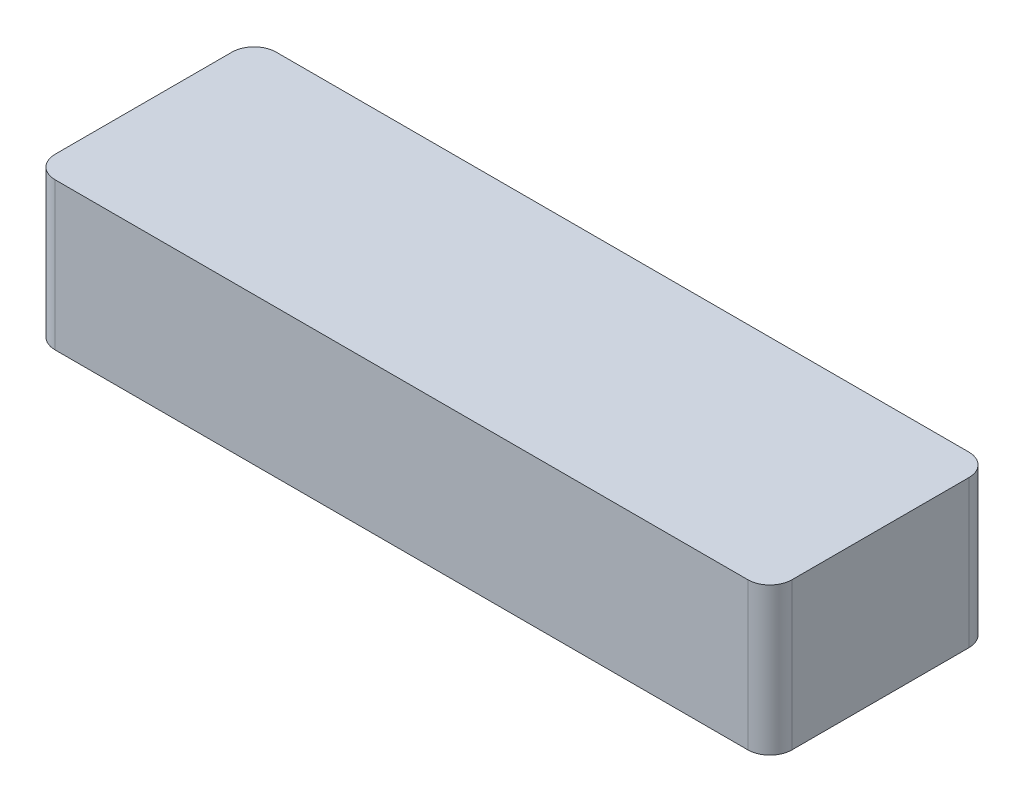
ISO-10303-21;
HEADER;
FILE_DESCRIPTION(('STEP AP214'),'2;1');
FILE_NAME('part.step','',(''),(''),'','','');
FILE_SCHEMA(('AUTOMOTIVE_DESIGN { 1 0 10303 214 1 1 1 1 }'));
ENDSEC;
DATA;
#1=APPLICATION_CONTEXT('core data for automotive mechanical design processes');
#2=APPLICATION_PROTOCOL_DEFINITION('international standard','automotive_design',2000,#1);
#3=PRODUCT_CONTEXT('',#1,'mechanical');
#4=PRODUCT('Part','Part','',(#3));
#5=PRODUCT_RELATED_PRODUCT_CATEGORY('part','',(#4));
#6=PRODUCT_DEFINITION_FORMATION('','',#4);
#7=PRODUCT_DEFINITION_CONTEXT('part definition',#1,'design');
#8=PRODUCT_DEFINITION('design','',#6,#7);
#9=PRODUCT_DEFINITION_SHAPE('','',#8);
#10=(LENGTH_UNIT() NAMED_UNIT(*) SI_UNIT(.MILLI.,.METRE.));
#11=(NAMED_UNIT(*) PLANE_ANGLE_UNIT() SI_UNIT($,.RADIAN.));
#12=(NAMED_UNIT(*) SI_UNIT($,.STERADIAN.) SOLID_ANGLE_UNIT());
#13=UNCERTAINTY_MEASURE_WITH_UNIT(LENGTH_MEASURE(1.E-05),#10,'distance_accuracy_value','');
#14=(GEOMETRIC_REPRESENTATION_CONTEXT(3) GLOBAL_UNCERTAINTY_ASSIGNED_CONTEXT((#13)) GLOBAL_UNIT_ASSIGNED_CONTEXT((#10,
#11,#12)) REPRESENTATION_CONTEXT('',''));
#15=CARTESIAN_POINT('',(0.,0.,0.));
#16=DIRECTION('',(0.,0.,1.));
#17=DIRECTION('',(1.,0.,0.));
#18=AXIS2_PLACEMENT_3D('',#15,#16,#17);
#19=CARTESIAN_POINT('',(-235.,100.,60.));
#20=DIRECTION('',(0.,-1.,0.));
#21=DIRECTION('',(0.,0.,-1.));
#22=AXIS2_PLACEMENT_3D('',#19,#20,#21);
#23=CYLINDRICAL_SURFACE('',#22,15.);
#24=CARTESIAN_POINT('',(-235.,0.,60.));
#25=DIRECTION('',(0.,1.,0.));
#26=DIRECTION('',(0.,0.,1.));
#27=AXIS2_PLACEMENT_3D('',#24,#25,#26);
#28=CIRCLE('',#27,15.);
#29=CARTESIAN_POINT('',(-250.,0.,59.9999999999999));
#30=VERTEX_POINT('',#29);
#31=CARTESIAN_POINT('',(-235.,0.,75.));
#32=VERTEX_POINT('',#31);
#33=EDGE_CURVE('E141',#30,#32,#28,.T.);
#34=ORIENTED_EDGE('',*,*,#33,.T.);
#35=DIRECTION('',(0.,-1.,0.));
#36=VECTOR('',#35,1.);
#37=CARTESIAN_POINT('',(-235.,100.,75.));
#38=LINE('',#37,#36);
#39=CARTESIAN_POINT('',(-235.,100.,75.));
#40=VERTEX_POINT('',#39);
#41=EDGE_CURVE('E11',#40,#32,#38,.T.);
#42=ORIENTED_EDGE('',*,*,#41,.F.);
#43=CARTESIAN_POINT('',(-235.,100.,60.));
#44=DIRECTION('',(0.,1.,0.));
#45=DIRECTION('',(0.,0.,1.));
#46=AXIS2_PLACEMENT_3D('',#43,#44,#45);
#47=CIRCLE('',#46,15.);
#48=CARTESIAN_POINT('',(-250.,100.,59.9999999999999));
#49=VERTEX_POINT('',#48);
#50=EDGE_CURVE('E157',#49,#40,#47,.T.);
#51=ORIENTED_EDGE('',*,*,#50,.F.);
#52=DIRECTION('',(0.,-1.,0.));
#53=VECTOR('',#52,1.);
#54=CARTESIAN_POINT('',(-250.,100.,59.9999999999999));
#55=LINE('',#54,#53);
#56=EDGE_CURVE('E137',#49,#30,#55,.T.);
#57=ORIENTED_EDGE('',*,*,#56,.T.);
#58=EDGE_LOOP('',(#34,#42,#51,#57));
#59=FACE_BOUND('',#58,.T.);
#60=ADVANCED_FACE('F33',(#59),#23,.T.);
#61=CARTESIAN_POINT('',(-235.,100.,75.));
#62=DIRECTION('',(0.,0.,-1.));
#63=DIRECTION('',(-1.,0.,0.));
#64=AXIS2_PLACEMENT_3D('',#61,#62,#63);
#65=PLANE('',#64);
#66=DIRECTION('',(1.,0.,0.));
#67=VECTOR('',#66,1.);
#68=CARTESIAN_POINT('',(-235.,0.,75.));
#69=LINE('',#68,#67);
#70=CARTESIAN_POINT('',(235.,0.,75.));
#71=VERTEX_POINT('',#70);
#72=EDGE_CURVE('E144',#32,#71,#69,.T.);
#73=ORIENTED_EDGE('',*,*,#72,.T.);
#74=DIRECTION('',(0.,-1.,0.));
#75=VECTOR('',#74,1.);
#76=CARTESIAN_POINT('',(235.,100.,75.));
#77=LINE('',#76,#75);
#78=CARTESIAN_POINT('',(235.,100.,75.));
#79=VERTEX_POINT('',#78);
#80=EDGE_CURVE('E40',#79,#71,#77,.T.);
#81=ORIENTED_EDGE('',*,*,#80,.F.);
#82=DIRECTION('',(1.,0.,0.));
#83=VECTOR('',#82,1.);
#84=CARTESIAN_POINT('',(-235.,100.,75.));
#85=LINE('',#84,#83);
#86=EDGE_CURVE('E97',#40,#79,#85,.T.);
#87=ORIENTED_EDGE('',*,*,#86,.F.);
#88=ORIENTED_EDGE('',*,*,#41,.T.);
#89=EDGE_LOOP('',(#73,#81,#87,#88));
#90=FACE_BOUND('',#89,.T.);
#91=ADVANCED_FACE('F320',(#90),#65,.F.);
#92=CARTESIAN_POINT('',(235.,100.,60.));
#93=DIRECTION('',(0.,-1.,0.));
#94=DIRECTION('',(0.,0.,-1.));
#95=AXIS2_PLACEMENT_3D('',#92,#93,#94);
#96=CYLINDRICAL_SURFACE('',#95,15.);
#97=CARTESIAN_POINT('',(235.,0.,60.));
#98=DIRECTION('',(0.,1.,0.));
#99=DIRECTION('',(0.,0.,1.));
#100=AXIS2_PLACEMENT_3D('',#97,#98,#99);
#101=CIRCLE('',#100,15.);
#102=CARTESIAN_POINT('',(250.,0.,59.9999999999999));
#103=VERTEX_POINT('',#102);
#104=EDGE_CURVE('E147',#71,#103,#101,.T.);
#105=ORIENTED_EDGE('',*,*,#104,.T.);
#106=DIRECTION('',(0.,-1.,0.));
#107=VECTOR('',#106,1.);
#108=CARTESIAN_POINT('',(250.,100.,59.9999999999999));
#109=LINE('',#108,#107);
#110=CARTESIAN_POINT('',(250.,100.,59.9999999999999));
#111=VERTEX_POINT('',#110);
#112=EDGE_CURVE('E164',#111,#103,#109,.T.);
#113=ORIENTED_EDGE('',*,*,#112,.F.);
#114=CARTESIAN_POINT('',(235.,100.,60.));
#115=DIRECTION('',(0.,1.,0.));
#116=DIRECTION('',(0.,0.,1.));
#117=AXIS2_PLACEMENT_3D('',#114,#115,#116);
#118=CIRCLE('',#117,15.);
#119=EDGE_CURVE('E172',#79,#111,#118,.T.);
#120=ORIENTED_EDGE('',*,*,#119,.F.);
#121=ORIENTED_EDGE('',*,*,#80,.T.);
#122=EDGE_LOOP('',(#105,#113,#120,#121));
#123=FACE_BOUND('',#122,.T.);
#124=ADVANCED_FACE('F170',(#123),#96,.T.);
#125=CARTESIAN_POINT('',(250.,100.,59.9999999999999));
#126=DIRECTION('',(-1.,0.,0.));
#127=DIRECTION('',(0.,0.,1.));
#128=AXIS2_PLACEMENT_3D('',#125,#126,#127);
#129=PLANE('',#128);
#130=DIRECTION('',(0.,0.,-1.));
#131=VECTOR('',#130,1.);
#132=CARTESIAN_POINT('',(250.,0.,59.9999999999999));
#133=LINE('',#132,#131);
#134=CARTESIAN_POINT('',(250.,0.,-59.9999999999999));
#135=VERTEX_POINT('',#134);
#136=EDGE_CURVE('E149',#103,#135,#133,.T.);
#137=ORIENTED_EDGE('',*,*,#136,.T.);
#138=DIRECTION('',(0.,-1.,0.));
#139=VECTOR('',#138,1.);
#140=CARTESIAN_POINT('',(250.,100.,-59.9999999999999));
#141=LINE('',#140,#139);
#142=CARTESIAN_POINT('',(250.,100.,-59.9999999999999));
#143=VERTEX_POINT('',#142);
#144=EDGE_CURVE('E161',#143,#135,#141,.T.);
#145=ORIENTED_EDGE('',*,*,#144,.F.);
#146=DIRECTION('',(0.,0.,-1.));
#147=VECTOR('',#146,1.);
#148=CARTESIAN_POINT('',(250.,100.,59.9999999999999));
#149=LINE('',#148,#147);
#150=EDGE_CURVE('E184',#111,#143,#149,.T.);
#151=ORIENTED_EDGE('',*,*,#150,.F.);
#152=ORIENTED_EDGE('',*,*,#112,.T.);
#153=EDGE_LOOP('',(#137,#145,#151,#152));
#154=FACE_BOUND('',#153,.T.);
#155=ADVANCED_FACE('F180',(#154),#129,.F.);
#156=CARTESIAN_POINT('',(235.,100.,-60.));
#157=DIRECTION('',(0.,-1.,0.));
#158=DIRECTION('',(0.,0.,-1.));
#159=AXIS2_PLACEMENT_3D('',#156,#157,#158);
#160=CYLINDRICAL_SURFACE('',#159,15.);
#161=CARTESIAN_POINT('',(235.,0.,-60.));
#162=DIRECTION('',(0.,1.,0.));
#163=DIRECTION('',(0.,0.,1.));
#164=AXIS2_PLACEMENT_3D('',#161,#162,#163);
#165=CIRCLE('',#164,15.);
#166=CARTESIAN_POINT('',(235.,0.,-75.));
#167=VERTEX_POINT('',#166);
#168=EDGE_CURVE('E151',#135,#167,#165,.T.);
#169=ORIENTED_EDGE('',*,*,#168,.T.);
#170=DIRECTION('',(0.,-1.,0.));
#171=VECTOR('',#170,1.);
#172=CARTESIAN_POINT('',(235.,100.,-75.));
#173=LINE('',#172,#171);
#174=CARTESIAN_POINT('',(235.,100.,-75.));
#175=VERTEX_POINT('',#174);
#176=EDGE_CURVE('E132',#175,#167,#173,.T.);
#177=ORIENTED_EDGE('',*,*,#176,.F.);
#178=CARTESIAN_POINT('',(235.,100.,-60.));
#179=DIRECTION('',(0.,1.,0.));
#180=DIRECTION('',(0.,0.,1.));
#181=AXIS2_PLACEMENT_3D('',#178,#179,#180);
#182=CIRCLE('',#181,15.);
#183=EDGE_CURVE('E120',#143,#175,#182,.T.);
#184=ORIENTED_EDGE('',*,*,#183,.F.);
#185=ORIENTED_EDGE('',*,*,#144,.T.);
#186=EDGE_LOOP('',(#169,#177,#184,#185));
#187=FACE_BOUND('',#186,.T.);
#188=ADVANCED_FACE('F183',(#187),#160,.T.);
#189=CARTESIAN_POINT('',(-235.,100.,-75.));
#190=DIRECTION('',(0.,0.,1.));
#191=DIRECTION('',(1.,0.,0.));
#192=AXIS2_PLACEMENT_3D('',#189,#190,#191);
#193=PLANE('',#192);
#194=DIRECTION('',(-1.,0.,0.));
#195=VECTOR('',#194,1.);
#196=CARTESIAN_POINT('',(-235.,0.,-75.));
#197=LINE('',#196,#195);
#198=CARTESIAN_POINT('',(-235.,0.,-75.));
#199=VERTEX_POINT('',#198);
#200=EDGE_CURVE('E129',#167,#199,#197,.T.);
#201=ORIENTED_EDGE('',*,*,#200,.T.);
#202=DIRECTION('',(0.,-1.,0.));
#203=VECTOR('',#202,1.);
#204=CARTESIAN_POINT('',(-235.,100.,-75.));
#205=LINE('',#204,#203);
#206=CARTESIAN_POINT('',(-235.,100.,-75.));
#207=VERTEX_POINT('',#206);
#208=EDGE_CURVE('E126',#207,#199,#205,.T.);
#209=ORIENTED_EDGE('',*,*,#208,.F.);
#210=DIRECTION('',(-1.,0.,0.));
#211=VECTOR('',#210,1.);
#212=CARTESIAN_POINT('',(-235.,100.,-75.));
#213=LINE('',#212,#211);
#214=EDGE_CURVE('E113',#175,#207,#213,.T.);
#215=ORIENTED_EDGE('',*,*,#214,.F.);
#216=ORIENTED_EDGE('',*,*,#176,.T.);
#217=EDGE_LOOP('',(#201,#209,#215,#216));
#218=FACE_BOUND('',#217,.T.);
#219=ADVANCED_FACE('F127',(#218),#193,.F.);
#220=CARTESIAN_POINT('',(-235.,100.,-60.));
#221=DIRECTION('',(0.,-1.,0.));
#222=DIRECTION('',(0.,0.,-1.));
#223=AXIS2_PLACEMENT_3D('',#220,#221,#222);
#224=CYLINDRICAL_SURFACE('',#223,15.);
#225=CARTESIAN_POINT('',(-235.,0.,-60.));
#226=DIRECTION('',(0.,1.,0.));
#227=DIRECTION('',(0.,0.,1.));
#228=AXIS2_PLACEMENT_3D('',#225,#226,#227);
#229=CIRCLE('',#228,15.);
#230=CARTESIAN_POINT('',(-250.,0.,-59.9999999999999));
#231=VERTEX_POINT('',#230);
#232=EDGE_CURVE('E154',#199,#231,#229,.T.);
#233=ORIENTED_EDGE('',*,*,#232,.T.);
#234=DIRECTION('',(0.,-1.,0.));
#235=VECTOR('',#234,1.);
#236=CARTESIAN_POINT('',(-250.,100.,-59.9999999999999));
#237=LINE('',#236,#235);
#238=CARTESIAN_POINT('',(-250.,100.,-59.9999999999999));
#239=VERTEX_POINT('',#238);
#240=EDGE_CURVE('E133',#239,#231,#237,.T.);
#241=ORIENTED_EDGE('',*,*,#240,.F.);
#242=CARTESIAN_POINT('',(-235.,100.,-60.));
#243=DIRECTION('',(0.,1.,0.));
#244=DIRECTION('',(0.,0.,1.));
#245=AXIS2_PLACEMENT_3D('',#242,#243,#244);
#246=CIRCLE('',#245,15.);
#247=EDGE_CURVE('E117',#207,#239,#246,.T.);
#248=ORIENTED_EDGE('',*,*,#247,.F.);
#249=ORIENTED_EDGE('',*,*,#208,.T.);
#250=EDGE_LOOP('',(#233,#241,#248,#249));
#251=FACE_BOUND('',#250,.T.);
#252=ADVANCED_FACE('F135',(#251),#224,.T.);
#253=CARTESIAN_POINT('',(-250.,100.,59.9999999999999));
#254=DIRECTION('',(1.,0.,0.));
#255=DIRECTION('',(0.,0.,-1.));
#256=AXIS2_PLACEMENT_3D('',#253,#254,#255);
#257=PLANE('',#256);
#258=DIRECTION('',(0.,0.,1.));
#259=VECTOR('',#258,1.);
#260=CARTESIAN_POINT('',(-250.,0.,59.9999999999999));
#261=LINE('',#260,#259);
#262=EDGE_CURVE('E89',#231,#30,#261,.T.);
#263=ORIENTED_EDGE('',*,*,#262,.T.);
#264=ORIENTED_EDGE('',*,*,#56,.F.);
#265=DIRECTION('',(0.,0.,1.));
#266=VECTOR('',#265,1.);
#267=CARTESIAN_POINT('',(-250.,100.,59.9999999999999));
#268=LINE('',#267,#266);
#269=EDGE_CURVE('E56',#239,#49,#268,.T.);
#270=ORIENTED_EDGE('',*,*,#269,.F.);
#271=ORIENTED_EDGE('',*,*,#240,.T.);
#272=EDGE_LOOP('',(#263,#264,#270,#271));
#273=FACE_BOUND('',#272,.T.);
#274=ADVANCED_FACE('F327',(#273),#257,.F.);
#275=CARTESIAN_POINT('',(-235.,100.,60.));
#276=DIRECTION('',(0.,1.,0.));
#277=DIRECTION('',(0.,0.,1.));
#278=AXIS2_PLACEMENT_3D('',#275,#276,#277);
#279=PLANE('',#278);
#280=ORIENTED_EDGE('',*,*,#50,.T.);
#281=ORIENTED_EDGE('',*,*,#86,.T.);
#282=ORIENTED_EDGE('',*,*,#119,.T.);
#283=ORIENTED_EDGE('',*,*,#150,.T.);
#284=ORIENTED_EDGE('',*,*,#183,.T.);
#285=ORIENTED_EDGE('',*,*,#214,.T.);
#286=ORIENTED_EDGE('',*,*,#247,.T.);
#287=ORIENTED_EDGE('',*,*,#269,.T.);
#288=EDGE_LOOP('',(#280,#281,#282,#283,#284,#285,#286,#287));
#289=FACE_BOUND('',#288,.T.);
#290=ADVANCED_FACE('F115',(#289),#279,.T.);
#291=CARTESIAN_POINT('',(-235.,0.,60.));
#292=DIRECTION('',(0.,1.,0.));
#293=DIRECTION('',(0.,0.,1.));
#294=AXIS2_PLACEMENT_3D('',#291,#292,#293);
#295=PLANE('',#294);
#296=DIRECTION('',(0.,0.,1.));
#297=VECTOR('',#296,1.);
#298=CARTESIAN_POINT('',(-245.,0.,59.9999999999999));
#299=LINE('',#298,#297);
#300=CARTESIAN_POINT('',(-245.,0.,-59.9999999999999));
#301=VERTEX_POINT('',#300);
#302=CARTESIAN_POINT('',(-245.,0.,59.9999999999999));
#303=VERTEX_POINT('',#302);
#304=EDGE_CURVE('E207',#301,#303,#299,.T.);
#305=ORIENTED_EDGE('',*,*,#304,.T.);
#306=CARTESIAN_POINT('',(-235.,0.,60.));
#307=DIRECTION('',(0.,1.,0.));
#308=DIRECTION('',(0.,0.,1.));
#309=AXIS2_PLACEMENT_3D('',#306,#307,#308);
#310=CIRCLE('',#309,10.);
#311=CARTESIAN_POINT('',(-235.,0.,70.));
#312=VERTEX_POINT('',#311);
#313=EDGE_CURVE('E193',#303,#312,#310,.T.);
#314=ORIENTED_EDGE('',*,*,#313,.T.);
#315=DIRECTION('',(1.,0.,0.));
#316=VECTOR('',#315,1.);
#317=CARTESIAN_POINT('',(-235.,0.,70.));
#318=LINE('',#317,#316);
#319=CARTESIAN_POINT('',(235.,0.,70.));
#320=VERTEX_POINT('',#319);
#321=EDGE_CURVE('E190',#312,#320,#318,.T.);
#322=ORIENTED_EDGE('',*,*,#321,.T.);
#323=CARTESIAN_POINT('',(235.,0.,60.));
#324=DIRECTION('',(0.,1.,0.));
#325=DIRECTION('',(0.,0.,1.));
#326=AXIS2_PLACEMENT_3D('',#323,#324,#325);
#327=CIRCLE('',#326,10.);
#328=CARTESIAN_POINT('',(245.,0.,59.9999999999999));
#329=VERTEX_POINT('',#328);
#330=EDGE_CURVE('E47',#320,#329,#327,.T.);
#331=ORIENTED_EDGE('',*,*,#330,.T.);
#332=DIRECTION('',(0.,0.,-1.));
#333=VECTOR('',#332,1.);
#334=CARTESIAN_POINT('',(245.,0.,59.9999999999999));
#335=LINE('',#334,#333);
#336=CARTESIAN_POINT('',(245.,0.,-59.9999999999999));
#337=VERTEX_POINT('',#336);
#338=EDGE_CURVE('E195',#329,#337,#335,.T.);
#339=ORIENTED_EDGE('',*,*,#338,.T.);
#340=CARTESIAN_POINT('',(235.,0.,-60.));
#341=DIRECTION('',(0.,1.,0.));
#342=DIRECTION('',(0.,0.,1.));
#343=AXIS2_PLACEMENT_3D('',#340,#341,#342);
#344=CIRCLE('',#343,10.);
#345=CARTESIAN_POINT('',(235.,0.,-70.));
#346=VERTEX_POINT('',#345);
#347=EDGE_CURVE('E198',#337,#346,#344,.T.);
#348=ORIENTED_EDGE('',*,*,#347,.T.);
#349=DIRECTION('',(-1.,0.,0.));
#350=VECTOR('',#349,1.);
#351=CARTESIAN_POINT('',(-235.,0.,-70.));
#352=LINE('',#351,#350);
#353=CARTESIAN_POINT('',(-235.,0.,-70.));
#354=VERTEX_POINT('',#353);
#355=EDGE_CURVE('E201',#346,#354,#352,.T.);
#356=ORIENTED_EDGE('',*,*,#355,.T.);
#357=CARTESIAN_POINT('',(-235.,0.,-60.));
#358=DIRECTION('',(0.,1.,0.));
#359=DIRECTION('',(0.,0.,1.));
#360=AXIS2_PLACEMENT_3D('',#357,#358,#359);
#361=CIRCLE('',#360,10.);
#362=EDGE_CURVE('E204',#354,#301,#361,.T.);
#363=ORIENTED_EDGE('',*,*,#362,.T.);
#364=EDGE_LOOP('',(#305,#314,#322,#331,#339,#348,#356,#363));
#365=FACE_BOUND('',#364,.T.);
#366=ORIENTED_EDGE('',*,*,#33,.F.);
#367=ORIENTED_EDGE('',*,*,#262,.F.);
#368=ORIENTED_EDGE('',*,*,#232,.F.);
#369=ORIENTED_EDGE('',*,*,#200,.F.);
#370=ORIENTED_EDGE('',*,*,#168,.F.);
#371=ORIENTED_EDGE('',*,*,#136,.F.);
#372=ORIENTED_EDGE('',*,*,#104,.F.);
#373=ORIENTED_EDGE('',*,*,#72,.F.);
#374=EDGE_LOOP('',(#366,#367,#368,#369,#370,#371,#372,#373));
#375=FACE_BOUND('',#374,.T.);
#376=ADVANCED_FACE('F176',(#365,#375),#295,.F.);
#377=CARTESIAN_POINT('',(-235.,100.,60.));
#378=DIRECTION('',(0.,-1.,0.));
#379=DIRECTION('',(0.,0.,-1.));
#380=AXIS2_PLACEMENT_3D('',#377,#378,#379);
#381=CYLINDRICAL_SURFACE('',#380,10.);
#382=ORIENTED_EDGE('',*,*,#313,.F.);
#383=DIRECTION('',(0.,-1.,0.));
#384=VECTOR('',#383,1.);
#385=CARTESIAN_POINT('',(-245.,100.,59.9999999999999));
#386=LINE('',#385,#384);
#387=CARTESIAN_POINT('',(-245.,95.,59.9999999999999));
#388=VERTEX_POINT('',#387);
#389=EDGE_CURVE('E216',#388,#303,#386,.T.);
#390=ORIENTED_EDGE('',*,*,#389,.F.);
#391=CARTESIAN_POINT('',(-235.,95.,60.));
#392=DIRECTION('',(0.,1.,0.));
#393=DIRECTION('',(0.,0.,1.));
#394=AXIS2_PLACEMENT_3D('',#391,#392,#393);
#395=CIRCLE('',#394,10.);
#396=CARTESIAN_POINT('',(-235.,95.,70.));
#397=VERTEX_POINT('',#396);
#398=EDGE_CURVE('E210',#388,#397,#395,.T.);
#399=ORIENTED_EDGE('',*,*,#398,.T.);
#400=DIRECTION('',(0.,1.,0.));
#401=VECTOR('',#400,1.);
#402=CARTESIAN_POINT('',(-235.,100.,70.));
#403=LINE('',#402,#401);
#404=EDGE_CURVE('E145',#397,#312,#403,.F.);
#405=ORIENTED_EDGE('',*,*,#404,.T.);
#406=EDGE_LOOP('',(#382,#390,#399,#405));
#407=FACE_BOUND('',#406,.T.);
#408=ADVANCED_FACE('F259',(#407),#381,.F.);
#409=CARTESIAN_POINT('',(-235.,100.,70.));
#410=DIRECTION('',(0.,0.,-1.));
#411=DIRECTION('',(-1.,0.,0.));
#412=AXIS2_PLACEMENT_3D('',#409,#410,#411);
#413=PLANE('',#412);
#414=ORIENTED_EDGE('',*,*,#321,.F.);
#415=ORIENTED_EDGE('',*,*,#404,.F.);
#416=DIRECTION('',(1.,0.,0.));
#417=VECTOR('',#416,1.);
#418=CARTESIAN_POINT('',(-235.,95.,70.));
#419=LINE('',#418,#417);
#420=CARTESIAN_POINT('',(235.,95.,70.));
#421=VERTEX_POINT('',#420);
#422=EDGE_CURVE('E245',#397,#421,#419,.T.);
#423=ORIENTED_EDGE('',*,*,#422,.T.);
#424=DIRECTION('',(0.,-1.,0.));
#425=VECTOR('',#424,1.);
#426=CARTESIAN_POINT('',(235.,100.,70.));
#427=LINE('',#426,#425);
#428=EDGE_CURVE('E247',#421,#320,#427,.T.);
#429=ORIENTED_EDGE('',*,*,#428,.T.);
#430=EDGE_LOOP('',(#414,#415,#423,#429));
#431=FACE_BOUND('',#430,.T.);
#432=ADVANCED_FACE('F391',(#431),#413,.T.);
#433=CARTESIAN_POINT('',(235.,100.,60.));
#434=DIRECTION('',(0.,-1.,0.));
#435=DIRECTION('',(0.,0.,-1.));
#436=AXIS2_PLACEMENT_3D('',#433,#434,#435);
#437=CYLINDRICAL_SURFACE('',#436,10.);
#438=ORIENTED_EDGE('',*,*,#330,.F.);
#439=ORIENTED_EDGE('',*,*,#428,.F.);
#440=CARTESIAN_POINT('',(235.,95.,60.));
#441=DIRECTION('',(0.,1.,0.));
#442=DIRECTION('',(0.,0.,1.));
#443=AXIS2_PLACEMENT_3D('',#440,#441,#442);
#444=CIRCLE('',#443,10.);
#445=CARTESIAN_POINT('',(245.,95.,59.9999999999999));
#446=VERTEX_POINT('',#445);
#447=EDGE_CURVE('E239',#421,#446,#444,.T.);
#448=ORIENTED_EDGE('',*,*,#447,.T.);
#449=DIRECTION('',(0.,1.,0.));
#450=VECTOR('',#449,1.);
#451=CARTESIAN_POINT('',(245.,100.,59.9999999999999));
#452=LINE('',#451,#450);
#453=EDGE_CURVE('E242',#446,#329,#452,.F.);
#454=ORIENTED_EDGE('',*,*,#453,.T.);
#455=EDGE_LOOP('',(#438,#439,#448,#454));
#456=FACE_BOUND('',#455,.T.);
#457=ADVANCED_FACE('F288',(#456),#437,.F.);
#458=CARTESIAN_POINT('',(245.,100.,59.9999999999999));
#459=DIRECTION('',(-1.,0.,0.));
#460=DIRECTION('',(0.,0.,1.));
#461=AXIS2_PLACEMENT_3D('',#458,#459,#460);
#462=PLANE('',#461);
#463=ORIENTED_EDGE('',*,*,#338,.F.);
#464=ORIENTED_EDGE('',*,*,#453,.F.);
#465=DIRECTION('',(0.,0.,-1.));
#466=VECTOR('',#465,1.);
#467=CARTESIAN_POINT('',(245.,95.,59.9999999999999));
#468=LINE('',#467,#466);
#469=CARTESIAN_POINT('',(245.,95.,-59.9999999999999));
#470=VERTEX_POINT('',#469);
#471=EDGE_CURVE('E233',#446,#470,#468,.T.);
#472=ORIENTED_EDGE('',*,*,#471,.T.);
#473=DIRECTION('',(0.,-1.,0.));
#474=VECTOR('',#473,1.);
#475=CARTESIAN_POINT('',(245.,100.,-59.9999999999999));
#476=LINE('',#475,#474);
#477=EDGE_CURVE('E236',#470,#337,#476,.T.);
#478=ORIENTED_EDGE('',*,*,#477,.T.);
#479=EDGE_LOOP('',(#463,#464,#472,#478));
#480=FACE_BOUND('',#479,.T.);
#481=ADVANCED_FACE('F293',(#480),#462,.T.);
#482=CARTESIAN_POINT('',(235.,100.,-60.));
#483=DIRECTION('',(0.,-1.,0.));
#484=DIRECTION('',(0.,0.,-1.));
#485=AXIS2_PLACEMENT_3D('',#482,#483,#484);
#486=CYLINDRICAL_SURFACE('',#485,10.);
#487=ORIENTED_EDGE('',*,*,#347,.F.);
#488=ORIENTED_EDGE('',*,*,#477,.F.);
#489=CARTESIAN_POINT('',(235.,95.,-60.));
#490=DIRECTION('',(0.,1.,0.));
#491=DIRECTION('',(0.,0.,1.));
#492=AXIS2_PLACEMENT_3D('',#489,#490,#491);
#493=CIRCLE('',#492,10.);
#494=CARTESIAN_POINT('',(235.,95.,-70.));
#495=VERTEX_POINT('',#494);
#496=EDGE_CURVE('E227',#470,#495,#493,.T.);
#497=ORIENTED_EDGE('',*,*,#496,.T.);
#498=DIRECTION('',(0.,1.,0.));
#499=VECTOR('',#498,1.);
#500=CARTESIAN_POINT('',(235.,100.,-70.));
#501=LINE('',#500,#499);
#502=EDGE_CURVE('E230',#495,#346,#501,.F.);
#503=ORIENTED_EDGE('',*,*,#502,.T.);
#504=EDGE_LOOP('',(#487,#488,#497,#503));
#505=FACE_BOUND('',#504,.T.);
#506=ADVANCED_FACE('F298',(#505),#486,.F.);
#507=CARTESIAN_POINT('',(-235.,100.,-70.));
#508=DIRECTION('',(0.,0.,1.));
#509=DIRECTION('',(1.,0.,0.));
#510=AXIS2_PLACEMENT_3D('',#507,#508,#509);
#511=PLANE('',#510);
#512=ORIENTED_EDGE('',*,*,#355,.F.);
#513=ORIENTED_EDGE('',*,*,#502,.F.);
#514=DIRECTION('',(-1.,0.,0.));
#515=VECTOR('',#514,1.);
#516=CARTESIAN_POINT('',(-235.,95.,-70.));
#517=LINE('',#516,#515);
#518=CARTESIAN_POINT('',(-235.,95.,-70.));
#519=VERTEX_POINT('',#518);
#520=EDGE_CURVE('E220',#495,#519,#517,.T.);
#521=ORIENTED_EDGE('',*,*,#520,.T.);
#522=DIRECTION('',(0.,-1.,0.));
#523=VECTOR('',#522,1.);
#524=CARTESIAN_POINT('',(-235.,100.,-70.));
#525=LINE('',#524,#523);
#526=EDGE_CURVE('E224',#519,#354,#525,.T.);
#527=ORIENTED_EDGE('',*,*,#526,.T.);
#528=EDGE_LOOP('',(#512,#513,#521,#527));
#529=FACE_BOUND('',#528,.T.);
#530=ADVANCED_FACE('F305',(#529),#511,.T.);
#531=CARTESIAN_POINT('',(-235.,100.,-60.));
#532=DIRECTION('',(0.,-1.,0.));
#533=DIRECTION('',(0.,0.,-1.));
#534=AXIS2_PLACEMENT_3D('',#531,#532,#533);
#535=CYLINDRICAL_SURFACE('',#534,10.);
#536=ORIENTED_EDGE('',*,*,#362,.F.);
#537=ORIENTED_EDGE('',*,*,#526,.F.);
#538=CARTESIAN_POINT('',(-235.,95.,-60.));
#539=DIRECTION('',(0.,1.,0.));
#540=DIRECTION('',(0.,0.,1.));
#541=AXIS2_PLACEMENT_3D('',#538,#539,#540);
#542=CIRCLE('',#541,10.);
#543=CARTESIAN_POINT('',(-245.,95.,-59.9999999999999));
#544=VERTEX_POINT('',#543);
#545=EDGE_CURVE('E217',#519,#544,#542,.T.);
#546=ORIENTED_EDGE('',*,*,#545,.T.);
#547=DIRECTION('',(0.,1.,0.));
#548=VECTOR('',#547,1.);
#549=CARTESIAN_POINT('',(-245.,100.,-59.9999999999999));
#550=LINE('',#549,#548);
#551=EDGE_CURVE('E221',#544,#301,#550,.F.);
#552=ORIENTED_EDGE('',*,*,#551,.T.);
#553=EDGE_LOOP('',(#536,#537,#546,#552));
#554=FACE_BOUND('',#553,.T.);
#555=ADVANCED_FACE('F309',(#554),#535,.F.);
#556=CARTESIAN_POINT('',(-245.,100.,59.9999999999999));
#557=DIRECTION('',(1.,0.,0.));
#558=DIRECTION('',(0.,0.,-1.));
#559=AXIS2_PLACEMENT_3D('',#556,#557,#558);
#560=PLANE('',#559);
#561=ORIENTED_EDGE('',*,*,#304,.F.);
#562=ORIENTED_EDGE('',*,*,#551,.F.);
#563=DIRECTION('',(0.,0.,1.));
#564=VECTOR('',#563,1.);
#565=CARTESIAN_POINT('',(-245.,95.,59.9999999999999));
#566=LINE('',#565,#564);
#567=EDGE_CURVE('E213',#544,#388,#566,.T.);
#568=ORIENTED_EDGE('',*,*,#567,.T.);
#569=ORIENTED_EDGE('',*,*,#389,.T.);
#570=EDGE_LOOP('',(#561,#562,#568,#569));
#571=FACE_BOUND('',#570,.T.);
#572=ADVANCED_FACE('F274',(#571),#560,.T.);
#573=CARTESIAN_POINT('',(-235.,95.,60.));
#574=DIRECTION('',(0.,1.,0.));
#575=DIRECTION('',(0.,0.,1.));
#576=AXIS2_PLACEMENT_3D('',#573,#574,#575);
#577=PLANE('',#576);
#578=ORIENTED_EDGE('',*,*,#398,.F.);
#579=ORIENTED_EDGE('',*,*,#567,.F.);
#580=ORIENTED_EDGE('',*,*,#545,.F.);
#581=ORIENTED_EDGE('',*,*,#520,.F.);
#582=ORIENTED_EDGE('',*,*,#496,.F.);
#583=ORIENTED_EDGE('',*,*,#471,.F.);
#584=ORIENTED_EDGE('',*,*,#447,.F.);
#585=ORIENTED_EDGE('',*,*,#422,.F.);
#586=EDGE_LOOP('',(#578,#579,#580,#581,#582,#583,#584,#585));
#587=FACE_BOUND('',#586,.T.);
#588=ADVANCED_FACE('F316',(#587),#577,.F.);
#589=CLOSED_SHELL('',(#60,#91,#124,#155,#188,#219,#252,#274,#290,#376,#408,#432,#457,#481,#506,
#530,#555,#572,#588));
#590=MANIFOLD_SOLID_BREP('B2',#589);
#591=ADVANCED_BREP_SHAPE_REPRESENTATION('',(#18,#590),#14);
#592=SHAPE_DEFINITION_REPRESENTATION(#9,#591);
ENDSEC;
END-ISO-10303-21;
